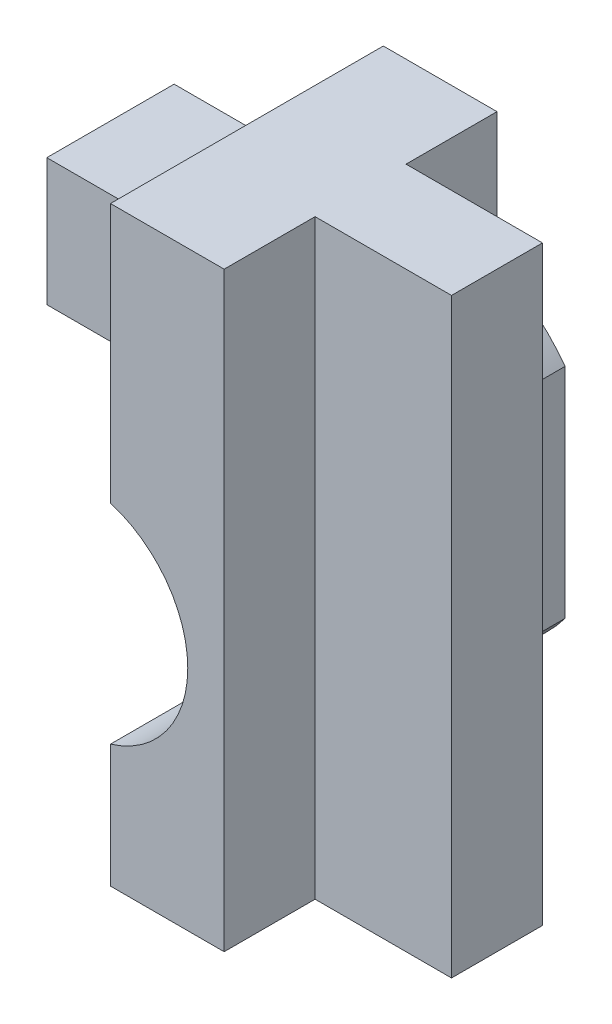
ISO-10303-21;
HEADER;
FILE_DESCRIPTION(('STEP AP214'),'2;1');
FILE_NAME('part.step','',(''),(''),'','','');
FILE_SCHEMA(('AUTOMOTIVE_DESIGN { 1 0 10303 214 1 1 1 1 }'));
ENDSEC;
DATA;
#1=APPLICATION_CONTEXT('core data for automotive mechanical design processes');
#2=APPLICATION_PROTOCOL_DEFINITION('international standard','automotive_design',2000,#1);
#3=PRODUCT_CONTEXT('',#1,'mechanical');
#4=PRODUCT('Part','Part','',(#3));
#5=PRODUCT_RELATED_PRODUCT_CATEGORY('part','',(#4));
#6=PRODUCT_DEFINITION_FORMATION('','',#4);
#7=PRODUCT_DEFINITION_CONTEXT('part definition',#1,'design');
#8=PRODUCT_DEFINITION('design','',#6,#7);
#9=PRODUCT_DEFINITION_SHAPE('','',#8);
#10=(LENGTH_UNIT() NAMED_UNIT(*) SI_UNIT(.MILLI.,.METRE.));
#11=(NAMED_UNIT(*) PLANE_ANGLE_UNIT() SI_UNIT($,.RADIAN.));
#12=(NAMED_UNIT(*) SI_UNIT($,.STERADIAN.) SOLID_ANGLE_UNIT());
#13=UNCERTAINTY_MEASURE_WITH_UNIT(LENGTH_MEASURE(1.E-05),#10,'distance_accuracy_value','');
#14=(GEOMETRIC_REPRESENTATION_CONTEXT(3) GLOBAL_UNCERTAINTY_ASSIGNED_CONTEXT((#13)) GLOBAL_UNIT_ASSIGNED_CONTEXT((#10,
#11,#12)) REPRESENTATION_CONTEXT('',''));
#15=CARTESIAN_POINT('',(0.,0.,0.));
#16=DIRECTION('',(0.,0.,1.));
#17=DIRECTION('',(1.,0.,0.));
#18=AXIS2_PLACEMENT_3D('',#15,#16,#17);
#19=CARTESIAN_POINT('',(12.2,-5.,-7.5));
#20=DIRECTION('',(1.,0.,0.));
#21=DIRECTION('',(0.,1.,0.));
#22=AXIS2_PLACEMENT_3D('',#19,#20,#21);
#23=PLANE('',#22);
#24=DIRECTION('',(0.,0.,1.));
#25=VECTOR('',#24,1.);
#26=CARTESIAN_POINT('',(12.2,3.93827373350305,-1.5));
#27=LINE('',#26,#25);
#28=CARTESIAN_POINT('',(12.2,3.93827373350305,0.));
#29=VERTEX_POINT('',#28);
#30=CARTESIAN_POINT('',(12.2,3.93827373350305,-1.5));
#31=VERTEX_POINT('',#30);
#32=EDGE_CURVE('E266',#29,#31,#27,.F.);
#33=ORIENTED_EDGE('',*,*,#32,.T.);
#34=DIRECTION('',(0.,1.,0.));
#35=VECTOR('',#34,1.);
#36=CARTESIAN_POINT('',(12.2,0.,-1.5));
#37=LINE('',#36,#35);
#38=CARTESIAN_POINT('',(12.2,2.50399680510979,-1.5));
#39=VERTEX_POINT('',#38);
#40=EDGE_CURVE('E255',#39,#31,#37,.T.);
#41=ORIENTED_EDGE('',*,*,#40,.F.);
#42=DIRECTION('',(0.,0.,-1.));
#43=VECTOR('',#42,1.);
#44=CARTESIAN_POINT('',(12.2,2.50399680510979,6.));
#45=LINE('',#44,#43);
#46=CARTESIAN_POINT('',(12.2,2.50399680510979,4.));
#47=VERTEX_POINT('',#46);
#48=EDGE_CURVE('E263',#39,#47,#45,.F.);
#49=ORIENTED_EDGE('',*,*,#48,.T.);
#50=DIRECTION('',(0.,1.,0.));
#51=VECTOR('',#50,1.);
#52=CARTESIAN_POINT('',(12.2,0.,4.));
#53=LINE('',#52,#51);
#54=CARTESIAN_POINT('',(12.2,2.2956480566498,4.));
#55=VERTEX_POINT('',#54);
#56=EDGE_CURVE('E243',#55,#47,#53,.T.);
#57=ORIENTED_EDGE('',*,*,#56,.F.);
#58=DIRECTION('',(0.,0.,1.));
#59=VECTOR('',#58,1.);
#60=CARTESIAN_POINT('',(12.2,2.2956480566498,4.));
#61=LINE('',#60,#59);
#62=CARTESIAN_POINT('',(12.2,2.2956480566498,6.));
#63=VERTEX_POINT('',#62);
#64=EDGE_CURVE('E12',#63,#55,#61,.F.);
#65=ORIENTED_EDGE('',*,*,#64,.F.);
#66=DIRECTION('',(0.,1.,0.));
#67=VECTOR('',#66,1.);
#68=CARTESIAN_POINT('',(12.2,0.,6.));
#69=LINE('',#68,#67);
#70=CARTESIAN_POINT('',(12.2,8.,6.));
#71=VERTEX_POINT('',#70);
#72=EDGE_CURVE('E247',#63,#71,#69,.T.);
#73=ORIENTED_EDGE('',*,*,#72,.T.);
#74=DIRECTION('',(0.,0.,1.));
#75=VECTOR('',#74,1.);
#76=CARTESIAN_POINT('',(12.2,8.,-7.5));
#77=LINE('',#76,#75);
#78=CARTESIAN_POINT('',(12.2,8.,0.));
#79=VERTEX_POINT('',#78);
#80=EDGE_CURVE('E231',#79,#71,#77,.T.);
#81=ORIENTED_EDGE('',*,*,#80,.F.);
#82=DIRECTION('',(0.,1.,0.));
#83=VECTOR('',#82,1.);
#84=CARTESIAN_POINT('',(12.2,0.,0.));
#85=LINE('',#84,#83);
#86=EDGE_CURVE('E262',#29,#79,#85,.T.);
#87=ORIENTED_EDGE('',*,*,#86,.F.);
#88=EDGE_LOOP('',(#33,#41,#49,#57,#65,#73,#81,#87));
#89=FACE_BOUND('',#88,.T.);
#90=DIRECTION('',(0.,1.,0.));
#91=VECTOR('',#90,1.);
#92=CARTESIAN_POINT('',(12.2,-5.,4.4));
#93=LINE('',#92,#91);
#94=CARTESIAN_POINT('',(12.2,3.77366945943055,4.4));
#95=VERTEX_POINT('',#94);
#96=CARTESIAN_POINT('',(12.2,6.57366945943055,4.4));
#97=VERTEX_POINT('',#96);
#98=EDGE_CURVE('E213',#95,#97,#93,.T.);
#99=ORIENTED_EDGE('',*,*,#98,.F.);
#100=DIRECTION('',(0.,0.,1.));
#101=VECTOR('',#100,1.);
#102=CARTESIAN_POINT('',(12.2,3.77366945943055,-7.5));
#103=LINE('',#102,#101);
#104=CARTESIAN_POINT('',(12.2,3.77366945943055,1.6));
#105=VERTEX_POINT('',#104);
#106=EDGE_CURVE('E222',#105,#95,#103,.T.);
#107=ORIENTED_EDGE('',*,*,#106,.F.);
#108=DIRECTION('',(0.,-1.,0.));
#109=VECTOR('',#108,1.);
#110=CARTESIAN_POINT('',(12.2,-5.,1.6));
#111=LINE('',#110,#109);
#112=CARTESIAN_POINT('',(12.2,6.57366945943055,1.6));
#113=VERTEX_POINT('',#112);
#114=EDGE_CURVE('E187',#113,#105,#111,.T.);
#115=ORIENTED_EDGE('',*,*,#114,.F.);
#116=DIRECTION('',(0.,0.,-1.));
#117=VECTOR('',#116,1.);
#118=CARTESIAN_POINT('',(12.2,6.57366945943055,-7.5));
#119=LINE('',#118,#117);
#120=EDGE_CURVE('E217',#97,#113,#119,.T.);
#121=ORIENTED_EDGE('',*,*,#120,.F.);
#122=EDGE_LOOP('',(#99,#107,#115,#121));
#123=FACE_BOUND('',#122,.T.);
#124=ADVANCED_FACE('F45',(#89,#123),#23,.F.);
#125=CARTESIAN_POINT('',(0.,-8.60555127546399,2.));
#126=DIRECTION('',(0.,0.,1.));
#127=DIRECTION('',(1.,0.,0.));
#128=AXIS2_PLACEMENT_3D('',#125,#126,#127);
#129=PLANE('',#128);
#130=DIRECTION('',(0.,1.,0.));
#131=VECTOR('',#130,1.);
#132=CARTESIAN_POINT('',(17.7,-8.60555127546399,2.));
#133=LINE('',#132,#131);
#134=CARTESIAN_POINT('',(17.7,-5.,2.));
#135=VERTEX_POINT('',#134);
#136=CARTESIAN_POINT('',(17.7,8.,2.));
#137=VERTEX_POINT('',#136);
#138=EDGE_CURVE('E330',#135,#137,#133,.T.);
#139=ORIENTED_EDGE('',*,*,#138,.F.);
#140=DIRECTION('',(-1.,0.,0.));
#141=VECTOR('',#140,1.);
#142=CARTESIAN_POINT('',(0.,-5.,2.));
#143=LINE('',#142,#141);
#144=CARTESIAN_POINT('',(14.7,-5.,2.));
#145=VERTEX_POINT('',#144);
#146=EDGE_CURVE('E308',#135,#145,#143,.T.);
#147=ORIENTED_EDGE('',*,*,#146,.T.);
#148=DIRECTION('',(0.,1.,0.));
#149=VECTOR('',#148,1.);
#150=CARTESIAN_POINT('',(14.7,-8.60555127546399,2.));
#151=LINE('',#150,#149);
#152=CARTESIAN_POINT('',(14.7,8.,2.));
#153=VERTEX_POINT('',#152);
#154=EDGE_CURVE('E333',#145,#153,#151,.T.);
#155=ORIENTED_EDGE('',*,*,#154,.T.);
#156=DIRECTION('',(1.,0.,0.));
#157=VECTOR('',#156,1.);
#158=CARTESIAN_POINT('',(0.,8.,2.));
#159=LINE('',#158,#157);
#160=EDGE_CURVE('E319',#153,#137,#159,.T.);
#161=ORIENTED_EDGE('',*,*,#160,.T.);
#162=EDGE_LOOP('',(#139,#147,#155,#161));
#163=FACE_BOUND('',#162,.T.);
#164=ADVANCED_FACE('F446',(#163),#129,.F.);
#165=CARTESIAN_POINT('',(17.7,-8.60555127546399,6.));
#166=DIRECTION('',(-1.,0.,0.));
#167=DIRECTION('',(0.,0.,1.));
#168=AXIS2_PLACEMENT_3D('',#165,#166,#167);
#169=PLANE('',#168);
#170=DIRECTION('',(0.,1.,0.));
#171=VECTOR('',#170,1.);
#172=CARTESIAN_POINT('',(17.7,-8.60555127546399,3.99999999999998));
#173=LINE('',#172,#171);
#174=CARTESIAN_POINT('',(17.7,-5.,3.99999999999998));
#175=VERTEX_POINT('',#174);
#176=CARTESIAN_POINT('',(17.7,8.,3.99999999999998));
#177=VERTEX_POINT('',#176);
#178=EDGE_CURVE('E327',#175,#177,#173,.T.);
#179=ORIENTED_EDGE('',*,*,#178,.F.);
#180=DIRECTION('',(0.,0.,-1.));
#181=VECTOR('',#180,1.);
#182=CARTESIAN_POINT('',(17.7,-5.,6.));
#183=LINE('',#182,#181);
#184=EDGE_CURVE('E312',#175,#135,#183,.T.);
#185=ORIENTED_EDGE('',*,*,#184,.T.);
#186=ORIENTED_EDGE('',*,*,#138,.T.);
#187=DIRECTION('',(0.,0.,1.));
#188=VECTOR('',#187,1.);
#189=CARTESIAN_POINT('',(17.7,8.,6.));
#190=LINE('',#189,#188);
#191=EDGE_CURVE('E323',#137,#177,#190,.T.);
#192=ORIENTED_EDGE('',*,*,#191,.T.);
#193=EDGE_LOOP('',(#179,#185,#186,#192));
#194=FACE_BOUND('',#193,.T.);
#195=ADVANCED_FACE('F451',(#194),#169,.F.);
#196=CARTESIAN_POINT('',(0.,-8.60555127546399,3.99999999999999));
#197=DIRECTION('',(0.,0.,-1.));
#198=DIRECTION('',(-1.,0.,0.));
#199=AXIS2_PLACEMENT_3D('',#196,#197,#198);
#200=PLANE('',#199);
#201=DIRECTION('',(0.,1.,0.));
#202=VECTOR('',#201,1.);
#203=CARTESIAN_POINT('',(14.7,-8.60555127546399,3.99999999999998));
#204=LINE('',#203,#202);
#205=CARTESIAN_POINT('',(14.7,-5.,3.99999999999998));
#206=VERTEX_POINT('',#205);
#207=CARTESIAN_POINT('',(14.7,8.,3.99999999999998));
#208=VERTEX_POINT('',#207);
#209=EDGE_CURVE('E336',#206,#208,#204,.T.);
#210=ORIENTED_EDGE('',*,*,#209,.F.);
#211=DIRECTION('',(1.,0.,0.));
#212=VECTOR('',#211,1.);
#213=CARTESIAN_POINT('',(0.,-5.,3.99999999999999));
#214=LINE('',#213,#212);
#215=EDGE_CURVE('E311',#206,#175,#214,.T.);
#216=ORIENTED_EDGE('',*,*,#215,.T.);
#217=ORIENTED_EDGE('',*,*,#178,.T.);
#218=DIRECTION('',(-1.,0.,0.));
#219=VECTOR('',#218,1.);
#220=CARTESIAN_POINT('',(0.,8.,3.99999999999999));
#221=LINE('',#220,#219);
#222=EDGE_CURVE('E304',#177,#208,#221,.T.);
#223=ORIENTED_EDGE('',*,*,#222,.T.);
#224=EDGE_LOOP('',(#210,#216,#217,#223));
#225=FACE_BOUND('',#224,.T.);
#226=ADVANCED_FACE('F472',(#225),#200,.F.);
#227=CARTESIAN_POINT('',(14.7,0.,6.));
#228=DIRECTION('',(-1.,0.,0.));
#229=DIRECTION('',(0.,-1.,0.));
#230=AXIS2_PLACEMENT_3D('',#227,#228,#229);
#231=PLANE('',#230);
#232=DIRECTION('',(0.,0.,-1.));
#233=VECTOR('',#232,1.);
#234=CARTESIAN_POINT('',(14.7,-5.,6.));
#235=LINE('',#234,#233);
#236=CARTESIAN_POINT('',(14.7,-5.,6.));
#237=VERTEX_POINT('',#236);
#238=EDGE_CURVE('E369',#237,#206,#235,.T.);
#239=ORIENTED_EDGE('',*,*,#238,.T.);
#240=ORIENTED_EDGE('',*,*,#209,.T.);
#241=DIRECTION('',(0.,0.,-1.));
#242=VECTOR('',#241,1.);
#243=CARTESIAN_POINT('',(14.7,8.,6.));
#244=LINE('',#243,#242);
#245=CARTESIAN_POINT('',(14.7,8.,6.));
#246=VERTEX_POINT('',#245);
#247=EDGE_CURVE('E364',#246,#208,#244,.T.);
#248=ORIENTED_EDGE('',*,*,#247,.F.);
#249=DIRECTION('',(0.,1.,0.));
#250=VECTOR('',#249,1.);
#251=CARTESIAN_POINT('',(14.7,0.,6.));
#252=LINE('',#251,#250);
#253=EDGE_CURVE('E346',#237,#246,#252,.T.);
#254=ORIENTED_EDGE('',*,*,#253,.F.);
#255=EDGE_LOOP('',(#239,#240,#248,#254));
#256=FACE_BOUND('',#255,.T.);
#257=ADVANCED_FACE('F479',(#256),#231,.F.);
#258=ORIENTED_EDGE('',*,*,#154,.F.);
#259=CARTESIAN_POINT('',(14.7,-5.,0.));
#260=VERTEX_POINT('',#259);
#261=EDGE_CURVE('E368',#145,#260,#235,.T.);
#262=ORIENTED_EDGE('',*,*,#261,.T.);
#263=DIRECTION('',(0.,1.,0.));
#264=VECTOR('',#263,1.);
#265=CARTESIAN_POINT('',(14.7,0.,0.));
#266=LINE('',#265,#264);
#267=CARTESIAN_POINT('',(14.7,-2.4,0.));
#268=VERTEX_POINT('',#267);
#269=EDGE_CURVE('E358',#260,#268,#266,.T.);
#270=ORIENTED_EDGE('',*,*,#269,.T.);
#271=DIRECTION('',(0.,0.,1.));
#272=VECTOR('',#271,1.);
#273=CARTESIAN_POINT('',(14.7,-2.4,-1.5));
#274=LINE('',#273,#272);
#275=CARTESIAN_POINT('',(14.7,-2.4,-1.5));
#276=VERTEX_POINT('',#275);
#277=EDGE_CURVE('E295',#276,#268,#274,.T.);
#278=ORIENTED_EDGE('',*,*,#277,.F.);
#279=DIRECTION('',(0.,1.,0.));
#280=VECTOR('',#279,1.);
#281=CARTESIAN_POINT('',(14.7,0.,-1.5));
#282=LINE('',#281,#280);
#283=CARTESIAN_POINT('',(14.7,2.40000000000002,-1.5));
#284=VERTEX_POINT('',#283);
#285=EDGE_CURVE('E290',#276,#284,#282,.T.);
#286=ORIENTED_EDGE('',*,*,#285,.T.);
#287=DIRECTION('',(0.,0.,1.));
#288=VECTOR('',#287,1.);
#289=CARTESIAN_POINT('',(14.7,2.40000000000002,-1.5));
#290=LINE('',#289,#288);
#291=CARTESIAN_POINT('',(14.7,2.40000000000002,0.));
#292=VERTEX_POINT('',#291);
#293=EDGE_CURVE('E300',#284,#292,#290,.T.);
#294=ORIENTED_EDGE('',*,*,#293,.T.);
#295=CARTESIAN_POINT('',(14.7,8.,0.));
#296=VERTEX_POINT('',#295);
#297=EDGE_CURVE('E357',#292,#296,#266,.T.);
#298=ORIENTED_EDGE('',*,*,#297,.T.);
#299=EDGE_CURVE('E354',#153,#296,#244,.T.);
#300=ORIENTED_EDGE('',*,*,#299,.F.);
#301=EDGE_LOOP('',(#258,#262,#270,#278,#286,#294,#298,#300));
#302=FACE_BOUND('',#301,.T.);
#303=ADVANCED_FACE('F419',(#302),#231,.F.);
#304=CARTESIAN_POINT('',(11.5,0.,-1.5));
#305=DIRECTION('',(0.,0.,1.));
#306=DIRECTION('',(1.,0.,0.));
#307=AXIS2_PLACEMENT_3D('',#304,#305,#306);
#308=PLANE('',#307);
#309=CARTESIAN_POINT('',(11.5,0.,-1.5));
#310=DIRECTION('',(0.,0.,1.));
#311=DIRECTION('',(1.,0.,0.));
#312=AXIS2_PLACEMENT_3D('',#309,#310,#311);
#313=CIRCLE('',#312,4.);
#314=CARTESIAN_POINT('',(12.2,-3.93827373350304,-1.5));
#315=VERTEX_POINT('',#314);
#316=EDGE_CURVE('E291',#315,#276,#313,.T.);
#317=ORIENTED_EDGE('',*,*,#316,.F.);
#318=CARTESIAN_POINT('',(12.2,-2.50399680510978,-1.5));
#319=VERTEX_POINT('',#318);
#320=EDGE_CURVE('E250',#315,#319,#37,.T.);
#321=ORIENTED_EDGE('',*,*,#320,.T.);
#322=CARTESIAN_POINT('',(11.5,0.,-1.5));
#323=DIRECTION('',(0.,0.,1.));
#324=DIRECTION('',(1.,0.,0.));
#325=AXIS2_PLACEMENT_3D('',#322,#323,#324);
#326=CIRCLE('',#325,2.6);
#327=EDGE_CURVE('E281',#319,#39,#326,.T.);
#328=ORIENTED_EDGE('',*,*,#327,.T.);
#329=ORIENTED_EDGE('',*,*,#40,.T.);
#330=EDGE_CURVE('E286',#284,#31,#313,.T.);
#331=ORIENTED_EDGE('',*,*,#330,.F.);
#332=ORIENTED_EDGE('',*,*,#285,.F.);
#333=EDGE_LOOP('',(#317,#321,#328,#329,#331,#332));
#334=FACE_BOUND('',#333,.T.);
#335=ADVANCED_FACE('F401',(#334),#308,.F.);
#336=CARTESIAN_POINT('',(11.5,0.,-1.5));
#337=DIRECTION('',(0.,0.,1.));
#338=DIRECTION('',(1.,0.,0.));
#339=AXIS2_PLACEMENT_3D('',#336,#337,#338);
#340=CYLINDRICAL_SURFACE('',#339,4.);
#341=DIRECTION('',(0.,0.,1.));
#342=VECTOR('',#341,1.);
#343=CARTESIAN_POINT('',(12.2,-3.93827373350304,-1.5));
#344=LINE('',#343,#342);
#345=CARTESIAN_POINT('',(12.2,-3.93827373350304,0.));
#346=VERTEX_POINT('',#345);
#347=EDGE_CURVE('E254',#315,#346,#344,.T.);
#348=ORIENTED_EDGE('',*,*,#347,.F.);
#349=ORIENTED_EDGE('',*,*,#316,.T.);
#350=ORIENTED_EDGE('',*,*,#277,.T.);
#351=CARTESIAN_POINT('',(11.5,0.,0.));
#352=DIRECTION('',(0.,0.,1.));
#353=DIRECTION('',(1.,0.,0.));
#354=AXIS2_PLACEMENT_3D('',#351,#352,#353);
#355=CIRCLE('',#354,4.);
#356=EDGE_CURVE('E285',#346,#268,#355,.T.);
#357=ORIENTED_EDGE('',*,*,#356,.F.);
#358=EDGE_LOOP('',(#348,#349,#350,#357));
#359=FACE_BOUND('',#358,.T.);
#360=ADVANCED_FACE('F436',(#359),#340,.T.);
#361=ORIENTED_EDGE('',*,*,#32,.F.);
#362=EDGE_CURVE('E296',#292,#29,#355,.T.);
#363=ORIENTED_EDGE('',*,*,#362,.F.);
#364=ORIENTED_EDGE('',*,*,#293,.F.);
#365=ORIENTED_EDGE('',*,*,#330,.T.);
#366=EDGE_LOOP('',(#361,#363,#364,#365));
#367=FACE_BOUND('',#366,.T.);
#368=ADVANCED_FACE('F414',(#367),#340,.T.);
#369=CARTESIAN_POINT('',(0.,0.,0.));
#370=DIRECTION('',(0.,0.,1.));
#371=DIRECTION('',(1.,0.,0.));
#372=AXIS2_PLACEMENT_3D('',#369,#370,#371);
#373=PLANE('',#372);
#374=ORIENTED_EDGE('',*,*,#362,.T.);
#375=ORIENTED_EDGE('',*,*,#86,.T.);
#376=DIRECTION('',(1.,0.,0.));
#377=VECTOR('',#376,1.);
#378=CARTESIAN_POINT('',(0.,8.,0.));
#379=LINE('',#378,#377);
#380=EDGE_CURVE('E347',#79,#296,#379,.T.);
#381=ORIENTED_EDGE('',*,*,#380,.T.);
#382=ORIENTED_EDGE('',*,*,#297,.F.);
#383=EDGE_LOOP('',(#374,#375,#381,#382));
#384=FACE_BOUND('',#383,.T.);
#385=ADVANCED_FACE('F423',(#384),#373,.F.);
#386=DIRECTION('',(1.,0.,0.));
#387=VECTOR('',#386,1.);
#388=CARTESIAN_POINT('',(0.,-5.,0.));
#389=LINE('',#388,#387);
#390=CARTESIAN_POINT('',(12.2,-5.,0.));
#391=VERTEX_POINT('',#390);
#392=EDGE_CURVE('E316',#391,#260,#389,.T.);
#393=ORIENTED_EDGE('',*,*,#392,.F.);
#394=EDGE_CURVE('E258',#391,#346,#85,.T.);
#395=ORIENTED_EDGE('',*,*,#394,.T.);
#396=ORIENTED_EDGE('',*,*,#356,.T.);
#397=ORIENTED_EDGE('',*,*,#269,.F.);
#398=EDGE_LOOP('',(#393,#395,#396,#397));
#399=FACE_BOUND('',#398,.T.);
#400=ADVANCED_FACE('F434',(#399),#373,.F.);
#401=CARTESIAN_POINT('',(11.5,0.,4.));
#402=DIRECTION('',(0.,0.,1.));
#403=DIRECTION('',(1.,0.,0.));
#404=AXIS2_PLACEMENT_3D('',#401,#402,#403);
#405=CYLINDRICAL_SURFACE('',#404,2.4);
#406=CARTESIAN_POINT('',(11.5,0.,6.));
#407=DIRECTION('',(0.,0.,1.));
#408=DIRECTION('',(1.,0.,0.));
#409=AXIS2_PLACEMENT_3D('',#406,#407,#408);
#410=CIRCLE('',#409,2.4);
#411=CARTESIAN_POINT('',(12.2,-2.29564805664979,6.));
#412=VERTEX_POINT('',#411);
#413=EDGE_CURVE('E274',#412,#63,#410,.T.);
#414=ORIENTED_EDGE('',*,*,#413,.T.);
#415=ORIENTED_EDGE('',*,*,#64,.T.);
#416=CARTESIAN_POINT('',(11.5,0.,4.));
#417=DIRECTION('',(0.,0.,1.));
#418=DIRECTION('',(1.,0.,0.));
#419=AXIS2_PLACEMENT_3D('',#416,#417,#418);
#420=CIRCLE('',#419,2.4);
#421=CARTESIAN_POINT('',(12.2,-2.29564805664979,4.));
#422=VERTEX_POINT('',#421);
#423=EDGE_CURVE('E269',#422,#55,#420,.T.);
#424=ORIENTED_EDGE('',*,*,#423,.F.);
#425=DIRECTION('',(0.,0.,1.));
#426=VECTOR('',#425,1.);
#427=CARTESIAN_POINT('',(12.2,-2.29564805664979,4.));
#428=LINE('',#427,#426);
#429=EDGE_CURVE('E54',#422,#412,#428,.T.);
#430=ORIENTED_EDGE('',*,*,#429,.T.);
#431=EDGE_LOOP('',(#414,#415,#424,#430));
#432=FACE_BOUND('',#431,.T.);
#433=ADVANCED_FACE('F377',(#432),#405,.F.);
#434=CARTESIAN_POINT('',(11.5,0.,4.));
#435=DIRECTION('',(0.,0.,1.));
#436=DIRECTION('',(1.,0.,0.));
#437=AXIS2_PLACEMENT_3D('',#434,#435,#436);
#438=PLANE('',#437);
#439=CARTESIAN_POINT('',(11.5,0.,4.));
#440=DIRECTION('',(0.,0.,1.));
#441=DIRECTION('',(1.,0.,0.));
#442=AXIS2_PLACEMENT_3D('',#439,#440,#441);
#443=CIRCLE('',#442,2.6);
#444=CARTESIAN_POINT('',(12.2,-2.50399680510978,4.));
#445=VERTEX_POINT('',#444);
#446=EDGE_CURVE('E273',#445,#47,#443,.T.);
#447=ORIENTED_EDGE('',*,*,#446,.F.);
#448=EDGE_CURVE('E235',#445,#422,#53,.T.);
#449=ORIENTED_EDGE('',*,*,#448,.T.);
#450=ORIENTED_EDGE('',*,*,#423,.T.);
#451=ORIENTED_EDGE('',*,*,#56,.T.);
#452=EDGE_LOOP('',(#447,#449,#450,#451));
#453=FACE_BOUND('',#452,.T.);
#454=ADVANCED_FACE('F391',(#453),#438,.F.);
#455=CARTESIAN_POINT('',(0.,0.,6.));
#456=DIRECTION('',(0.,0.,1.));
#457=DIRECTION('',(1.,0.,0.));
#458=AXIS2_PLACEMENT_3D('',#455,#456,#457);
#459=PLANE('',#458);
#460=CARTESIAN_POINT('',(12.2,-5.,6.));
#461=VERTEX_POINT('',#460);
#462=EDGE_CURVE('E242',#461,#412,#69,.T.);
#463=ORIENTED_EDGE('',*,*,#462,.F.);
#464=DIRECTION('',(1.,0.,0.));
#465=VECTOR('',#464,1.);
#466=CARTESIAN_POINT('',(0.,-5.,6.));
#467=LINE('',#466,#465);
#468=EDGE_CURVE('E343',#461,#237,#467,.T.);
#469=ORIENTED_EDGE('',*,*,#468,.T.);
#470=ORIENTED_EDGE('',*,*,#253,.T.);
#471=DIRECTION('',(1.,0.,0.));
#472=VECTOR('',#471,1.);
#473=CARTESIAN_POINT('',(0.,8.,6.));
#474=LINE('',#473,#472);
#475=EDGE_CURVE('E351',#71,#246,#474,.T.);
#476=ORIENTED_EDGE('',*,*,#475,.F.);
#477=ORIENTED_EDGE('',*,*,#72,.F.);
#478=ORIENTED_EDGE('',*,*,#413,.F.);
#479=EDGE_LOOP('',(#463,#469,#470,#476,#477,#478));
#480=FACE_BOUND('',#479,.T.);
#481=ADVANCED_FACE('F382',(#480),#459,.T.);
#482=CARTESIAN_POINT('',(0.,8.,6.));
#483=DIRECTION('',(0.,1.,0.));
#484=DIRECTION('',(0.,0.,1.));
#485=AXIS2_PLACEMENT_3D('',#482,#483,#484);
#486=PLANE('',#485);
#487=ORIENTED_EDGE('',*,*,#80,.T.);
#488=ORIENTED_EDGE('',*,*,#475,.T.);
#489=ORIENTED_EDGE('',*,*,#247,.T.);
#490=ORIENTED_EDGE('',*,*,#222,.F.);
#491=ORIENTED_EDGE('',*,*,#191,.F.);
#492=ORIENTED_EDGE('',*,*,#160,.F.);
#493=ORIENTED_EDGE('',*,*,#299,.T.);
#494=ORIENTED_EDGE('',*,*,#380,.F.);
#495=EDGE_LOOP('',(#487,#488,#489,#490,#491,#492,#493,#494));
#496=FACE_BOUND('',#495,.T.);
#497=ADVANCED_FACE('F469',(#496),#486,.T.);
#498=CARTESIAN_POINT('',(0.,-5.,6.));
#499=DIRECTION('',(0.,1.,0.));
#500=DIRECTION('',(-1.,0.,0.));
#501=AXIS2_PLACEMENT_3D('',#498,#499,#500);
#502=PLANE('',#501);
#503=ORIENTED_EDGE('',*,*,#468,.F.);
#504=DIRECTION('',(0.,0.,1.));
#505=VECTOR('',#504,1.);
#506=CARTESIAN_POINT('',(12.2,-5.,-7.5));
#507=LINE('',#506,#505);
#508=EDGE_CURVE('E232',#391,#461,#507,.T.);
#509=ORIENTED_EDGE('',*,*,#508,.F.);
#510=ORIENTED_EDGE('',*,*,#392,.T.);
#511=ORIENTED_EDGE('',*,*,#261,.F.);
#512=ORIENTED_EDGE('',*,*,#146,.F.);
#513=ORIENTED_EDGE('',*,*,#184,.F.);
#514=ORIENTED_EDGE('',*,*,#215,.F.);
#515=ORIENTED_EDGE('',*,*,#238,.F.);
#516=EDGE_LOOP('',(#503,#509,#510,#511,#512,#513,#514,#515));
#517=FACE_BOUND('',#516,.T.);
#518=ADVANCED_FACE('F47',(#517),#502,.F.);
#519=CARTESIAN_POINT('',(11.5,0.,6.));
#520=DIRECTION('',(0.,0.,-1.));
#521=DIRECTION('',(-1.,0.,0.));
#522=AXIS2_PLACEMENT_3D('',#519,#520,#521);
#523=CYLINDRICAL_SURFACE('',#522,2.6);
#524=DIRECTION('',(0.,0.,-1.));
#525=VECTOR('',#524,1.);
#526=CARTESIAN_POINT('',(12.2,-2.50399680510978,6.));
#527=LINE('',#526,#525);
#528=EDGE_CURVE('E246',#445,#319,#527,.T.);
#529=ORIENTED_EDGE('',*,*,#528,.F.);
#530=ORIENTED_EDGE('',*,*,#446,.T.);
#531=ORIENTED_EDGE('',*,*,#48,.F.);
#532=ORIENTED_EDGE('',*,*,#327,.F.);
#533=EDGE_LOOP('',(#529,#530,#531,#532));
#534=FACE_BOUND('',#533,.T.);
#535=ADVANCED_FACE('F395',(#534),#523,.F.);
#536=ORIENTED_EDGE('',*,*,#508,.T.);
#537=ORIENTED_EDGE('',*,*,#462,.T.);
#538=ORIENTED_EDGE('',*,*,#429,.F.);
#539=ORIENTED_EDGE('',*,*,#448,.F.);
#540=ORIENTED_EDGE('',*,*,#528,.T.);
#541=ORIENTED_EDGE('',*,*,#320,.F.);
#542=ORIENTED_EDGE('',*,*,#347,.T.);
#543=ORIENTED_EDGE('',*,*,#394,.F.);
#544=EDGE_LOOP('',(#536,#537,#538,#539,#540,#541,#542,#543));
#545=FACE_BOUND('',#544,.T.);
#546=ADVANCED_FACE('F397',(#545),#23,.F.);
#547=CARTESIAN_POINT('',(9.2,-5.,4.4));
#548=DIRECTION('',(0.,0.,-1.));
#549=DIRECTION('',(-1.,0.,0.));
#550=AXIS2_PLACEMENT_3D('',#547,#548,#549);
#551=PLANE('',#550);
#552=DIRECTION('',(1.,0.,0.));
#553=VECTOR('',#552,1.);
#554=CARTESIAN_POINT('',(9.20000000000001,6.57366945943055,4.4));
#555=LINE('',#554,#553);
#556=CARTESIAN_POINT('',(9.20000000000001,6.57366945943055,4.4));
#557=VERTEX_POINT('',#556);
#558=EDGE_CURVE('E61',#557,#97,#555,.T.);
#559=ORIENTED_EDGE('',*,*,#558,.F.);
#560=DIRECTION('',(0.,1.,0.));
#561=VECTOR('',#560,1.);
#562=CARTESIAN_POINT('',(9.20000000000001,6.57366945943055,4.4));
#563=LINE('',#562,#561);
#564=CARTESIAN_POINT('',(9.2,3.77366945943055,4.4));
#565=VERTEX_POINT('',#564);
#566=EDGE_CURVE('E201',#565,#557,#563,.T.);
#567=ORIENTED_EDGE('',*,*,#566,.F.);
#568=DIRECTION('',(1.,0.,0.));
#569=VECTOR('',#568,1.);
#570=CARTESIAN_POINT('',(9.20000000000001,3.77366945943055,4.4));
#571=LINE('',#570,#569);
#572=EDGE_CURVE('E192',#565,#95,#571,.T.);
#573=ORIENTED_EDGE('',*,*,#572,.T.);
#574=ORIENTED_EDGE('',*,*,#98,.T.);
#575=EDGE_LOOP('',(#559,#567,#573,#574));
#576=FACE_BOUND('',#575,.T.);
#577=ADVANCED_FACE('F458',(#576),#551,.F.);
#578=CARTESIAN_POINT('',(9.20000000000001,6.57366945943055,-7.5));
#579=DIRECTION('',(0.,-1.,0.));
#580=DIRECTION('',(0.,0.,-1.));
#581=AXIS2_PLACEMENT_3D('',#578,#579,#580);
#582=PLANE('',#581);
#583=DIRECTION('',(1.,0.,0.));
#584=VECTOR('',#583,1.);
#585=CARTESIAN_POINT('',(9.20000000000001,6.57366945943055,1.6));
#586=LINE('',#585,#584);
#587=CARTESIAN_POINT('',(9.20000000000001,6.57366945943055,1.6));
#588=VERTEX_POINT('',#587);
#589=EDGE_CURVE('E69',#588,#113,#586,.T.);
#590=ORIENTED_EDGE('',*,*,#589,.F.);
#591=DIRECTION('',(0.,0.,-1.));
#592=VECTOR('',#591,1.);
#593=CARTESIAN_POINT('',(9.20000000000001,6.57366945943055,1.6));
#594=LINE('',#593,#592);
#595=EDGE_CURVE('E205',#557,#588,#594,.T.);
#596=ORIENTED_EDGE('',*,*,#595,.F.);
#597=ORIENTED_EDGE('',*,*,#558,.T.);
#598=ORIENTED_EDGE('',*,*,#120,.T.);
#599=EDGE_LOOP('',(#590,#596,#597,#598));
#600=FACE_BOUND('',#599,.T.);
#601=ADVANCED_FACE('F463',(#600),#582,.F.);
#602=CARTESIAN_POINT('',(9.2,-5.,1.6));
#603=DIRECTION('',(0.,0.,1.));
#604=DIRECTION('',(1.,0.,0.));
#605=AXIS2_PLACEMENT_3D('',#602,#603,#604);
#606=PLANE('',#605);
#607=DIRECTION('',(1.,0.,0.));
#608=VECTOR('',#607,1.);
#609=CARTESIAN_POINT('',(9.20000000000001,3.77366945943055,1.6));
#610=LINE('',#609,#608);
#611=CARTESIAN_POINT('',(9.2,3.77366945943055,1.6));
#612=VERTEX_POINT('',#611);
#613=EDGE_CURVE('E182',#612,#105,#610,.T.);
#614=ORIENTED_EDGE('',*,*,#613,.F.);
#615=DIRECTION('',(0.,-1.,0.));
#616=VECTOR('',#615,1.);
#617=CARTESIAN_POINT('',(9.20000000000001,6.57366945943055,1.6));
#618=LINE('',#617,#616);
#619=EDGE_CURVE('E186',#588,#612,#618,.T.);
#620=ORIENTED_EDGE('',*,*,#619,.F.);
#621=ORIENTED_EDGE('',*,*,#589,.T.);
#622=ORIENTED_EDGE('',*,*,#114,.T.);
#623=EDGE_LOOP('',(#614,#620,#621,#622));
#624=FACE_BOUND('',#623,.T.);
#625=ADVANCED_FACE('F184',(#624),#606,.F.);
#626=CARTESIAN_POINT('',(9.20000000000001,3.77366945943055,-7.5));
#627=DIRECTION('',(0.,1.,0.));
#628=DIRECTION('',(0.,0.,1.));
#629=AXIS2_PLACEMENT_3D('',#626,#627,#628);
#630=PLANE('',#629);
#631=ORIENTED_EDGE('',*,*,#572,.F.);
#632=DIRECTION('',(0.,0.,1.));
#633=VECTOR('',#632,1.);
#634=CARTESIAN_POINT('',(9.2,3.77366945943055,1.6));
#635=LINE('',#634,#633);
#636=EDGE_CURVE('E195',#612,#565,#635,.T.);
#637=ORIENTED_EDGE('',*,*,#636,.F.);
#638=ORIENTED_EDGE('',*,*,#613,.T.);
#639=ORIENTED_EDGE('',*,*,#106,.T.);
#640=EDGE_LOOP('',(#631,#637,#638,#639));
#641=FACE_BOUND('',#640,.T.);
#642=ADVANCED_FACE('F196',(#641),#630,.F.);
#643=CARTESIAN_POINT('',(9.2,0.,0.));
#644=DIRECTION('',(-1.,0.,0.));
#645=DIRECTION('',(0.,-1.,0.));
#646=AXIS2_PLACEMENT_3D('',#643,#644,#645);
#647=PLANE('',#646);
#648=ORIENTED_EDGE('',*,*,#619,.T.);
#649=ORIENTED_EDGE('',*,*,#636,.T.);
#650=ORIENTED_EDGE('',*,*,#566,.T.);
#651=ORIENTED_EDGE('',*,*,#595,.T.);
#652=EDGE_LOOP('',(#648,#649,#650,#651));
#653=FACE_BOUND('',#652,.T.);
#654=ADVANCED_FACE('F204',(#653),#647,.T.);
#655=CLOSED_SHELL('',(#124,#164,#195,#226,#257,#303,#335,#360,#368,#385,#400,#433,#454,#481,
#497,#518,#535,#546,#577,#601,#625,#642,#654));
#656=MANIFOLD_SOLID_BREP('B2',#655);
#657=ADVANCED_BREP_SHAPE_REPRESENTATION('',(#18,#656),#14);
#658=SHAPE_DEFINITION_REPRESENTATION(#9,#657);
ENDSEC;
END-ISO-10303-21;
